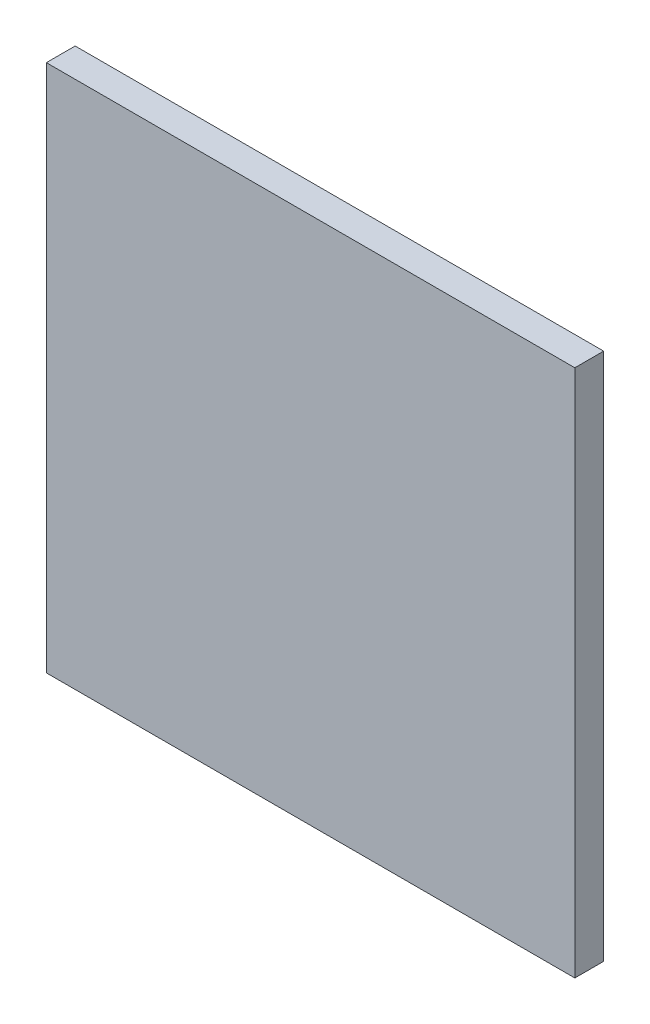
ISO-10303-21;
HEADER;
FILE_DESCRIPTION(('STEP AP214'),'2;1');
FILE_NAME('part.step','',(''),(''),'','','');
FILE_SCHEMA(('AUTOMOTIVE_DESIGN { 1 0 10303 214 1 1 1 1 }'));
ENDSEC;
DATA;
#1=APPLICATION_CONTEXT('core data for automotive mechanical design processes');
#2=APPLICATION_PROTOCOL_DEFINITION('international standard','automotive_design',2000,#1);
#3=PRODUCT_CONTEXT('',#1,'mechanical');
#4=PRODUCT('Part','Part','',(#3));
#5=PRODUCT_RELATED_PRODUCT_CATEGORY('part','',(#4));
#6=PRODUCT_DEFINITION_FORMATION('','',#4);
#7=PRODUCT_DEFINITION_CONTEXT('part definition',#1,'design');
#8=PRODUCT_DEFINITION('design','',#6,#7);
#9=PRODUCT_DEFINITION_SHAPE('','',#8);
#10=(LENGTH_UNIT() NAMED_UNIT(*) SI_UNIT(.MILLI.,.METRE.));
#11=(NAMED_UNIT(*) PLANE_ANGLE_UNIT() SI_UNIT($,.RADIAN.));
#12=(NAMED_UNIT(*) SI_UNIT($,.STERADIAN.) SOLID_ANGLE_UNIT());
#13=UNCERTAINTY_MEASURE_WITH_UNIT(LENGTH_MEASURE(1.E-05),#10,'distance_accuracy_value','');
#14=(GEOMETRIC_REPRESENTATION_CONTEXT(3) GLOBAL_UNCERTAINTY_ASSIGNED_CONTEXT((#13)) GLOBAL_UNIT_ASSIGNED_CONTEXT((#10,
#11,#12)) REPRESENTATION_CONTEXT('',''));
#15=CARTESIAN_POINT('',(0.,0.,0.));
#16=DIRECTION('',(0.,0.,1.));
#17=DIRECTION('',(1.,0.,0.));
#18=AXIS2_PLACEMENT_3D('',#15,#16,#17);
#19=CARTESIAN_POINT('',(0.,-27.5,3.));
#20=DIRECTION('',(0.,1.,0.));
#21=DIRECTION('',(0.,0.,1.));
#22=AXIS2_PLACEMENT_3D('',#19,#20,#21);
#23=PLANE('',#22);
#24=DIRECTION('',(1.,0.,0.));
#25=VECTOR('',#24,1.);
#26=CARTESIAN_POINT('',(0.,-27.5,0.));
#27=LINE('',#26,#25);
#28=CARTESIAN_POINT('',(-27.5,-27.5,0.));
#29=VERTEX_POINT('',#28);
#30=CARTESIAN_POINT('',(27.5,-27.5,0.));
#31=VERTEX_POINT('',#30);
#32=EDGE_CURVE('E98',#29,#31,#27,.T.);
#33=ORIENTED_EDGE('',*,*,#32,.T.);
#34=DIRECTION('',(0.,0.,-1.));
#35=VECTOR('',#34,1.);
#36=CARTESIAN_POINT('',(27.5,-27.5,3.));
#37=LINE('',#36,#35);
#38=CARTESIAN_POINT('',(27.5,-27.5,3.));
#39=VERTEX_POINT('',#38);
#40=EDGE_CURVE('E11',#39,#31,#37,.T.);
#41=ORIENTED_EDGE('',*,*,#40,.F.);
#42=DIRECTION('',(1.,0.,0.));
#43=VECTOR('',#42,1.);
#44=CARTESIAN_POINT('',(0.,-27.5,3.));
#45=LINE('',#44,#43);
#46=CARTESIAN_POINT('',(-27.5,-27.5,3.));
#47=VERTEX_POINT('',#46);
#48=EDGE_CURVE('E84',#47,#39,#45,.T.);
#49=ORIENTED_EDGE('',*,*,#48,.F.);
#50=DIRECTION('',(0.,0.,-1.));
#51=VECTOR('',#50,1.);
#52=CARTESIAN_POINT('',(-27.5,-27.5,3.));
#53=LINE('',#52,#51);
#54=EDGE_CURVE('E51',#47,#29,#53,.T.);
#55=ORIENTED_EDGE('',*,*,#54,.T.);
#56=EDGE_LOOP('',(#33,#41,#49,#55));
#57=FACE_BOUND('',#56,.T.);
#58=ADVANCED_FACE('F35',(#57),#23,.F.);
#59=CARTESIAN_POINT('',(27.5,0.,3.));
#60=DIRECTION('',(-1.,0.,0.));
#61=DIRECTION('',(0.,0.,1.));
#62=AXIS2_PLACEMENT_3D('',#59,#60,#61);
#63=PLANE('',#62);
#64=DIRECTION('',(0.,1.,0.));
#65=VECTOR('',#64,1.);
#66=CARTESIAN_POINT('',(27.5,0.,0.));
#67=LINE('',#66,#65);
#68=CARTESIAN_POINT('',(27.5,27.5,0.));
#69=VERTEX_POINT('',#68);
#70=EDGE_CURVE('E89',#31,#69,#67,.T.);
#71=ORIENTED_EDGE('',*,*,#70,.T.);
#72=DIRECTION('',(0.,0.,-1.));
#73=VECTOR('',#72,1.);
#74=CARTESIAN_POINT('',(27.5,27.5,3.));
#75=LINE('',#74,#73);
#76=CARTESIAN_POINT('',(27.5,27.5,3.));
#77=VERTEX_POINT('',#76);
#78=EDGE_CURVE('E43',#77,#69,#75,.T.);
#79=ORIENTED_EDGE('',*,*,#78,.F.);
#80=DIRECTION('',(0.,1.,0.));
#81=VECTOR('',#80,1.);
#82=CARTESIAN_POINT('',(27.5,0.,3.));
#83=LINE('',#82,#81);
#84=EDGE_CURVE('E76',#39,#77,#83,.T.);
#85=ORIENTED_EDGE('',*,*,#84,.F.);
#86=ORIENTED_EDGE('',*,*,#40,.T.);
#87=EDGE_LOOP('',(#71,#79,#85,#86));
#88=FACE_BOUND('',#87,.T.);
#89=ADVANCED_FACE('F88',(#88),#63,.F.);
#90=CARTESIAN_POINT('',(0.,27.5,3.));
#91=DIRECTION('',(0.,1.,0.));
#92=DIRECTION('',(0.,0.,1.));
#93=AXIS2_PLACEMENT_3D('',#90,#91,#92);
#94=PLANE('',#93);
#95=DIRECTION('',(1.,0.,0.));
#96=VECTOR('',#95,1.);
#97=CARTESIAN_POINT('',(0.,27.5,0.));
#98=LINE('',#97,#96);
#99=CARTESIAN_POINT('',(-27.5,27.5,0.));
#100=VERTEX_POINT('',#99);
#101=EDGE_CURVE('E101',#100,#69,#98,.T.);
#102=ORIENTED_EDGE('',*,*,#101,.F.);
#103=DIRECTION('',(0.,0.,-1.));
#104=VECTOR('',#103,1.);
#105=CARTESIAN_POINT('',(-27.5,27.5,3.));
#106=LINE('',#105,#104);
#107=CARTESIAN_POINT('',(-27.5,27.5,3.));
#108=VERTEX_POINT('',#107);
#109=EDGE_CURVE('E65',#108,#100,#106,.T.);
#110=ORIENTED_EDGE('',*,*,#109,.F.);
#111=DIRECTION('',(1.,0.,0.));
#112=VECTOR('',#111,1.);
#113=CARTESIAN_POINT('',(0.,27.5,3.));
#114=LINE('',#113,#112);
#115=EDGE_CURVE('E83',#108,#77,#114,.T.);
#116=ORIENTED_EDGE('',*,*,#115,.T.);
#117=ORIENTED_EDGE('',*,*,#78,.T.);
#118=EDGE_LOOP('',(#102,#110,#116,#117));
#119=FACE_BOUND('',#118,.T.);
#120=ADVANCED_FACE('F92',(#119),#94,.T.);
#121=CARTESIAN_POINT('',(-27.5,0.,3.));
#122=DIRECTION('',(-1.,0.,0.));
#123=DIRECTION('',(0.,0.,1.));
#124=AXIS2_PLACEMENT_3D('',#121,#122,#123);
#125=PLANE('',#124);
#126=DIRECTION('',(0.,1.,0.));
#127=VECTOR('',#126,1.);
#128=CARTESIAN_POINT('',(-27.5,0.,0.));
#129=LINE('',#128,#127);
#130=EDGE_CURVE('E103',#29,#100,#129,.T.);
#131=ORIENTED_EDGE('',*,*,#130,.F.);
#132=ORIENTED_EDGE('',*,*,#54,.F.);
#133=DIRECTION('',(0.,1.,0.));
#134=VECTOR('',#133,1.);
#135=CARTESIAN_POINT('',(-27.5,0.,3.));
#136=LINE('',#135,#134);
#137=EDGE_CURVE('E93',#47,#108,#136,.T.);
#138=ORIENTED_EDGE('',*,*,#137,.T.);
#139=ORIENTED_EDGE('',*,*,#109,.T.);
#140=EDGE_LOOP('',(#131,#132,#138,#139));
#141=FACE_BOUND('',#140,.T.);
#142=ADVANCED_FACE('F109',(#141),#125,.T.);
#143=CARTESIAN_POINT('',(0.,0.,3.));
#144=DIRECTION('',(0.,0.,1.));
#145=DIRECTION('',(1.,0.,0.));
#146=AXIS2_PLACEMENT_3D('',#143,#144,#145);
#147=PLANE('',#146);
#148=ORIENTED_EDGE('',*,*,#48,.T.);
#149=ORIENTED_EDGE('',*,*,#84,.T.);
#150=ORIENTED_EDGE('',*,*,#115,.F.);
#151=ORIENTED_EDGE('',*,*,#137,.F.);
#152=EDGE_LOOP('',(#148,#149,#150,#151));
#153=FACE_BOUND('',#152,.T.);
#154=ADVANCED_FACE('F80',(#153),#147,.T.);
#155=CARTESIAN_POINT('',(0.,0.,0.));
#156=DIRECTION('',(0.,0.,1.));
#157=DIRECTION('',(1.,0.,0.));
#158=AXIS2_PLACEMENT_3D('',#155,#156,#157);
#159=PLANE('',#158);
#160=ORIENTED_EDGE('',*,*,#32,.F.);
#161=ORIENTED_EDGE('',*,*,#130,.T.);
#162=ORIENTED_EDGE('',*,*,#101,.T.);
#163=ORIENTED_EDGE('',*,*,#70,.F.);
#164=EDGE_LOOP('',(#160,#161,#162,#163));
#165=FACE_BOUND('',#164,.T.);
#166=ADVANCED_FACE('F108',(#165),#159,.F.);
#167=CLOSED_SHELL('',(#58,#89,#120,#142,#154,#166));
#168=MANIFOLD_SOLID_BREP('B2',#167);
#169=ADVANCED_BREP_SHAPE_REPRESENTATION('',(#18,#168),#14);
#170=SHAPE_DEFINITION_REPRESENTATION(#9,#169);
ENDSEC;
END-ISO-10303-21;
